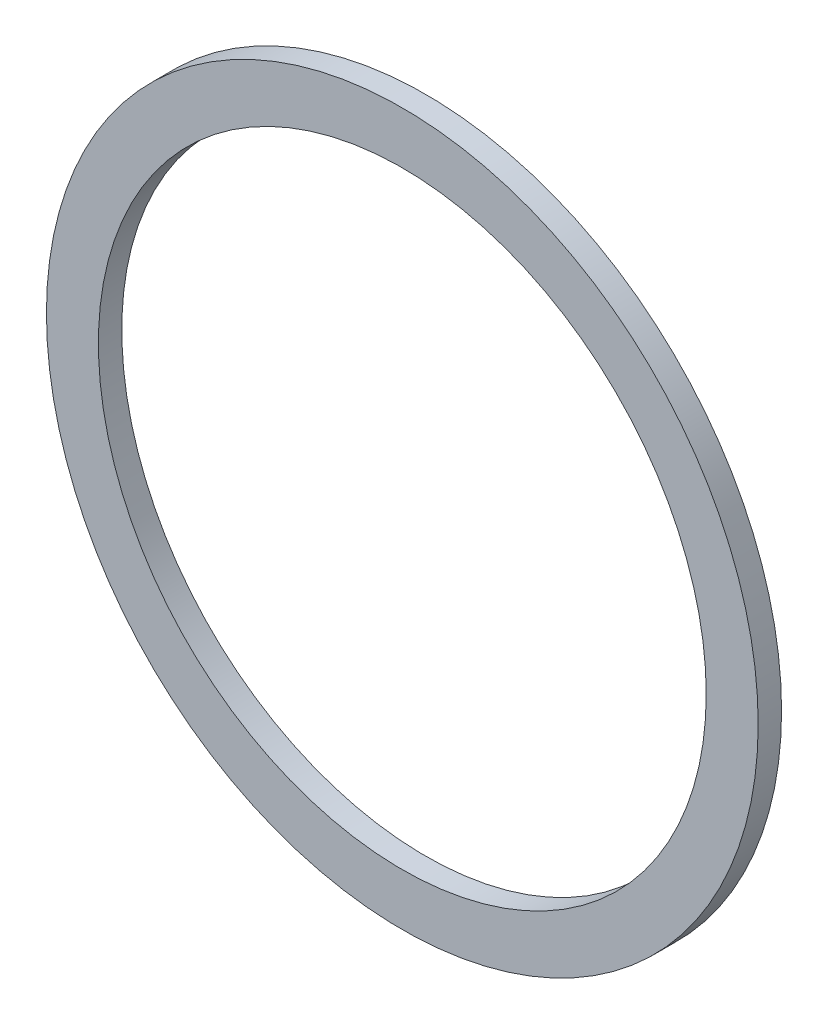
ISO-10303-21;
HEADER;
FILE_DESCRIPTION(('STEP AP214'),'2;1');
FILE_NAME('part.step','',(''),(''),'','','');
FILE_SCHEMA(('AUTOMOTIVE_DESIGN { 1 0 10303 214 1 1 1 1 }'));
ENDSEC;
DATA;
#1=APPLICATION_CONTEXT('core data for automotive mechanical design processes');
#2=APPLICATION_PROTOCOL_DEFINITION('international standard','automotive_design',2000,#1);
#3=PRODUCT_CONTEXT('',#1,'mechanical');
#4=PRODUCT('Part','Part','',(#3));
#5=PRODUCT_RELATED_PRODUCT_CATEGORY('part','',(#4));
#6=PRODUCT_DEFINITION_FORMATION('','',#4);
#7=PRODUCT_DEFINITION_CONTEXT('part definition',#1,'design');
#8=PRODUCT_DEFINITION('design','',#6,#7);
#9=PRODUCT_DEFINITION_SHAPE('','',#8);
#10=(LENGTH_UNIT() NAMED_UNIT(*) SI_UNIT(.MILLI.,.METRE.));
#11=(NAMED_UNIT(*) PLANE_ANGLE_UNIT() SI_UNIT($,.RADIAN.));
#12=(NAMED_UNIT(*) SI_UNIT($,.STERADIAN.) SOLID_ANGLE_UNIT());
#13=UNCERTAINTY_MEASURE_WITH_UNIT(LENGTH_MEASURE(1.E-05),#10,'distance_accuracy_value','');
#14=(GEOMETRIC_REPRESENTATION_CONTEXT(3) GLOBAL_UNCERTAINTY_ASSIGNED_CONTEXT((#13)) GLOBAL_UNIT_ASSIGNED_CONTEXT((#10,
#11,#12)) REPRESENTATION_CONTEXT('',''));
#15=CARTESIAN_POINT('',(0.,0.,0.));
#16=DIRECTION('',(0.,0.,1.));
#17=DIRECTION('',(1.,0.,0.));
#18=AXIS2_PLACEMENT_3D('',#15,#16,#17);
#19=CARTESIAN_POINT('',(0.,0.,1.8));
#20=DIRECTION('',(0.,0.,1.));
#21=DIRECTION('',(1.,0.,0.));
#22=AXIS2_PLACEMENT_3D('',#19,#20,#21);
#23=PLANE('',#22);
#24=CARTESIAN_POINT('',(0.,0.,1.8));
#25=DIRECTION('',(0.,0.,1.));
#26=DIRECTION('',(1.,0.,0.));
#27=AXIS2_PLACEMENT_3D('',#24,#25,#26);
#28=CIRCLE('',#27,27.4);
#29=CARTESIAN_POINT('',(27.4,0.,1.8));
#30=VERTEX_POINT('',#29);
#31=EDGE_CURVE('E10',#30,#30,#28,.T.);
#32=ORIENTED_EDGE('',*,*,#31,.T.);
#33=EDGE_LOOP('',(#32));
#34=FACE_BOUND('',#33,.T.);
#35=CARTESIAN_POINT('',(0.,0.,1.8));
#36=DIRECTION('',(0.,0.,1.));
#37=DIRECTION('',(1.,0.,0.));
#38=AXIS2_PLACEMENT_3D('',#35,#36,#37);
#39=CIRCLE('',#38,23.4);
#40=CARTESIAN_POINT('',(23.4,0.,1.8));
#41=VERTEX_POINT('',#40);
#42=EDGE_CURVE('E44',#41,#41,#39,.T.);
#43=ORIENTED_EDGE('',*,*,#42,.F.);
#44=EDGE_LOOP('',(#43));
#45=FACE_BOUND('',#44,.T.);
#46=ADVANCED_FACE('F33',(#34,#45),#23,.T.);
#47=CARTESIAN_POINT('',(0.,0.,0.));
#48=DIRECTION('',(0.,0.,1.));
#49=DIRECTION('',(1.,0.,0.));
#50=AXIS2_PLACEMENT_3D('',#47,#48,#49);
#51=PLANE('',#50);
#52=CARTESIAN_POINT('',(0.,0.,0.));
#53=DIRECTION('',(0.,0.,1.));
#54=DIRECTION('',(1.,0.,0.));
#55=AXIS2_PLACEMENT_3D('',#52,#53,#54);
#56=CIRCLE('',#55,27.4);
#57=CARTESIAN_POINT('',(27.4,0.,0.));
#58=VERTEX_POINT('',#57);
#59=EDGE_CURVE('E37',#58,#58,#56,.T.);
#60=ORIENTED_EDGE('',*,*,#59,.F.);
#61=EDGE_LOOP('',(#60));
#62=FACE_BOUND('',#61,.T.);
#63=CARTESIAN_POINT('',(0.,0.,0.));
#64=DIRECTION('',(0.,0.,1.));
#65=DIRECTION('',(1.,0.,0.));
#66=AXIS2_PLACEMENT_3D('',#63,#64,#65);
#67=CIRCLE('',#66,23.4);
#68=CARTESIAN_POINT('',(23.4,0.,0.));
#69=VERTEX_POINT('',#68);
#70=EDGE_CURVE('E46',#69,#69,#67,.T.);
#71=ORIENTED_EDGE('',*,*,#70,.T.);
#72=EDGE_LOOP('',(#71));
#73=FACE_BOUND('',#72,.T.);
#74=ADVANCED_FACE('F56',(#62,#73),#51,.F.);
#75=CARTESIAN_POINT('',(0.,0.,1.8));
#76=DIRECTION('',(0.,0.,-1.));
#77=DIRECTION('',(-1.,0.,0.));
#78=AXIS2_PLACEMENT_3D('',#75,#76,#77);
#79=CYLINDRICAL_SURFACE('',#78,27.4);
#80=ORIENTED_EDGE('',*,*,#31,.F.);
#81=EDGE_LOOP('',(#80));
#82=FACE_BOUND('',#81,.T.);
#83=ORIENTED_EDGE('',*,*,#59,.T.);
#84=EDGE_LOOP('',(#83));
#85=FACE_BOUND('',#84,.T.);
#86=ADVANCED_FACE('F35',(#82,#85),#79,.T.);
#87=CARTESIAN_POINT('',(0.,0.,1.8));
#88=DIRECTION('',(0.,0.,-1.));
#89=DIRECTION('',(-1.,0.,0.));
#90=AXIS2_PLACEMENT_3D('',#87,#88,#89);
#91=CYLINDRICAL_SURFACE('',#90,23.4);
#92=ORIENTED_EDGE('',*,*,#42,.T.);
#93=EDGE_LOOP('',(#92));
#94=FACE_BOUND('',#93,.T.);
#95=ORIENTED_EDGE('',*,*,#70,.F.);
#96=EDGE_LOOP('',(#95));
#97=FACE_BOUND('',#96,.T.);
#98=ADVANCED_FACE('F52',(#94,#97),#91,.F.);
#99=CLOSED_SHELL('',(#46,#74,#86,#98));
#100=MANIFOLD_SOLID_BREP('B2',#99);
#101=ADVANCED_BREP_SHAPE_REPRESENTATION('',(#18,#100),#14);
#102=SHAPE_DEFINITION_REPRESENTATION(#9,#101);
ENDSEC;
END-ISO-10303-21;
